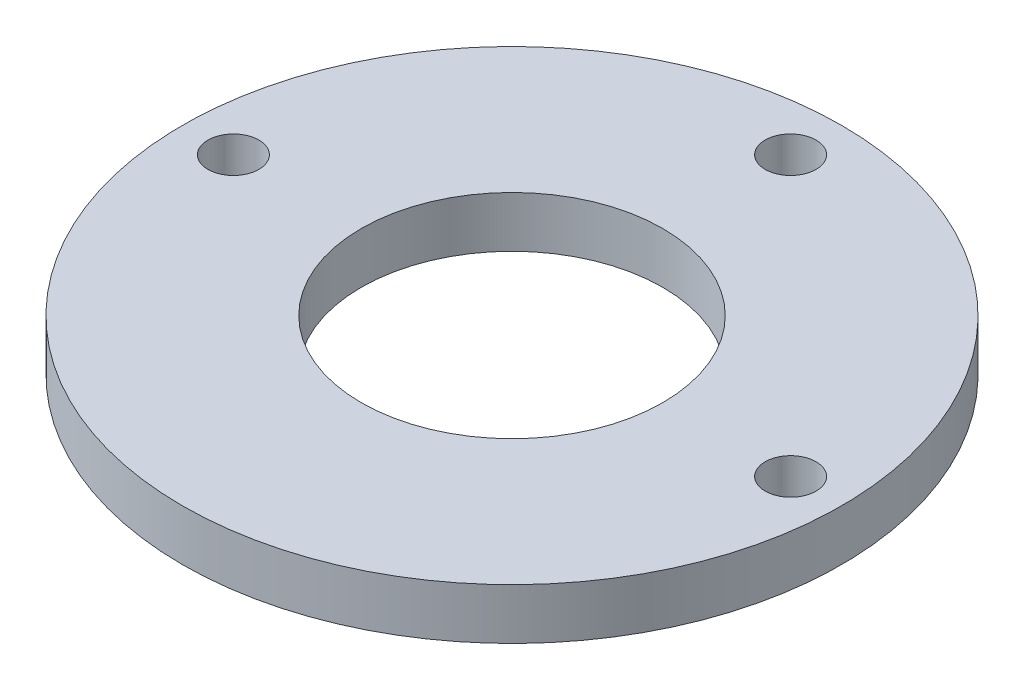
ISO-10303-21;
HEADER;
FILE_DESCRIPTION(('STEP AP214'),'2;1');
FILE_NAME('part.step','',(''),(''),'','','');
FILE_SCHEMA(('AUTOMOTIVE_DESIGN { 1 0 10303 214 1 1 1 1 }'));
ENDSEC;
DATA;
#1=APPLICATION_CONTEXT('core data for automotive mechanical design processes');
#2=APPLICATION_PROTOCOL_DEFINITION('international standard','automotive_design',2000,#1);
#3=PRODUCT_CONTEXT('',#1,'mechanical');
#4=PRODUCT('Part','Part','',(#3));
#5=PRODUCT_RELATED_PRODUCT_CATEGORY('part','',(#4));
#6=PRODUCT_DEFINITION_FORMATION('','',#4);
#7=PRODUCT_DEFINITION_CONTEXT('part definition',#1,'design');
#8=PRODUCT_DEFINITION('design','',#6,#7);
#9=PRODUCT_DEFINITION_SHAPE('','',#8);
#10=(LENGTH_UNIT() NAMED_UNIT(*) SI_UNIT(.MILLI.,.METRE.));
#11=(NAMED_UNIT(*) PLANE_ANGLE_UNIT() SI_UNIT($,.RADIAN.));
#12=(NAMED_UNIT(*) SI_UNIT($,.STERADIAN.) SOLID_ANGLE_UNIT());
#13=UNCERTAINTY_MEASURE_WITH_UNIT(LENGTH_MEASURE(1.E-05),#10,'distance_accuracy_value','');
#14=(GEOMETRIC_REPRESENTATION_CONTEXT(3) GLOBAL_UNCERTAINTY_ASSIGNED_CONTEXT((#13)) GLOBAL_UNIT_ASSIGNED_CONTEXT((#10,
#11,#12)) REPRESENTATION_CONTEXT('',''));
#15=CARTESIAN_POINT('',(0.,0.,0.));
#16=DIRECTION('',(0.,0.,1.));
#17=DIRECTION('',(1.,0.,0.));
#18=AXIS2_PLACEMENT_3D('',#15,#16,#17);
#19=CARTESIAN_POINT('',(0.,6.35,0.));
#20=DIRECTION('',(0.,-1.,0.));
#21=DIRECTION('',(0.,0.,-1.));
#22=AXIS2_PLACEMENT_3D('',#19,#20,#21);
#23=CYLINDRICAL_SURFACE('',#22,18.796);
#24=CARTESIAN_POINT('',(0.,6.35,0.));
#25=DIRECTION('',(0.,1.,0.));
#26=DIRECTION('',(0.,0.,1.));
#27=AXIS2_PLACEMENT_3D('',#24,#25,#26);
#28=CIRCLE('',#27,18.796);
#29=CARTESIAN_POINT('',(0.,6.35,18.796));
#30=VERTEX_POINT('',#29);
#31=EDGE_CURVE('E44',#30,#30,#28,.T.);
#32=ORIENTED_EDGE('',*,*,#31,.T.);
#33=EDGE_LOOP('',(#32));
#34=FACE_BOUND('',#33,.T.);
#35=CARTESIAN_POINT('',(0.,0.,0.));
#36=DIRECTION('',(0.,1.,0.));
#37=DIRECTION('',(0.,0.,1.));
#38=AXIS2_PLACEMENT_3D('',#35,#36,#37);
#39=CIRCLE('',#38,18.796);
#40=CARTESIAN_POINT('',(0.,0.,18.796));
#41=VERTEX_POINT('',#40);
#42=EDGE_CURVE('E61',#41,#41,#39,.T.);
#43=ORIENTED_EDGE('',*,*,#42,.F.);
#44=EDGE_LOOP('',(#43));
#45=FACE_BOUND('',#44,.T.);
#46=ADVANCED_FACE('F36',(#34,#45),#23,.F.);
#47=CARTESIAN_POINT('',(34.725,6.35,0.));
#48=DIRECTION('',(0.,-1.,0.));
#49=DIRECTION('',(0.,0.,-1.));
#50=AXIS2_PLACEMENT_3D('',#47,#48,#49);
#51=CYLINDRICAL_SURFACE('',#50,3.175);
#52=CARTESIAN_POINT('',(34.725,6.35,0.));
#53=DIRECTION('',(0.,1.,0.));
#54=DIRECTION('',(0.,0.,1.));
#55=AXIS2_PLACEMENT_3D('',#52,#53,#54);
#56=CIRCLE('',#55,3.175);
#57=CARTESIAN_POINT('',(34.725,6.35,3.175));
#58=VERTEX_POINT('',#57);
#59=EDGE_CURVE('E49',#58,#58,#56,.T.);
#60=ORIENTED_EDGE('',*,*,#59,.T.);
#61=EDGE_LOOP('',(#60));
#62=FACE_BOUND('',#61,.T.);
#63=CARTESIAN_POINT('',(34.725,0.,0.));
#64=DIRECTION('',(0.,1.,0.));
#65=DIRECTION('',(0.,0.,1.));
#66=AXIS2_PLACEMENT_3D('',#63,#64,#65);
#67=CIRCLE('',#66,3.175);
#68=CARTESIAN_POINT('',(34.725,0.,3.175));
#69=VERTEX_POINT('',#68);
#70=EDGE_CURVE('E59',#69,#69,#67,.T.);
#71=ORIENTED_EDGE('',*,*,#70,.F.);
#72=EDGE_LOOP('',(#71));
#73=FACE_BOUND('',#72,.T.);
#74=ADVANCED_FACE('F79',(#62,#73),#51,.F.);
#75=CARTESIAN_POINT('',(-34.725,6.35,0.));
#76=DIRECTION('',(0.,-1.,0.));
#77=DIRECTION('',(0.,0.,-1.));
#78=AXIS2_PLACEMENT_3D('',#75,#76,#77);
#79=CYLINDRICAL_SURFACE('',#78,3.175);
#80=CARTESIAN_POINT('',(-34.725,6.35,0.));
#81=DIRECTION('',(0.,1.,0.));
#82=DIRECTION('',(0.,0.,1.));
#83=AXIS2_PLACEMENT_3D('',#80,#81,#82);
#84=CIRCLE('',#83,3.175);
#85=CARTESIAN_POINT('',(-34.725,6.35,3.175));
#86=VERTEX_POINT('',#85);
#87=EDGE_CURVE('E70',#86,#86,#84,.T.);
#88=ORIENTED_EDGE('',*,*,#87,.T.);
#89=EDGE_LOOP('',(#88));
#90=FACE_BOUND('',#89,.T.);
#91=CARTESIAN_POINT('',(-34.725,0.,0.));
#92=DIRECTION('',(0.,1.,0.));
#93=DIRECTION('',(0.,0.,1.));
#94=AXIS2_PLACEMENT_3D('',#91,#92,#93);
#95=CIRCLE('',#94,3.175);
#96=CARTESIAN_POINT('',(-34.725,0.,3.175));
#97=VERTEX_POINT('',#96);
#98=EDGE_CURVE('E56',#97,#97,#95,.T.);
#99=ORIENTED_EDGE('',*,*,#98,.F.);
#100=EDGE_LOOP('',(#99));
#101=FACE_BOUND('',#100,.T.);
#102=ADVANCED_FACE('F97',(#90,#101),#79,.F.);
#103=CARTESIAN_POINT('',(0.,6.35,-34.725));
#104=DIRECTION('',(0.,-1.,0.));
#105=DIRECTION('',(0.,0.,-1.));
#106=AXIS2_PLACEMENT_3D('',#103,#104,#105);
#107=CYLINDRICAL_SURFACE('',#106,3.175);
#108=CARTESIAN_POINT('',(0.,6.35,-34.725));
#109=DIRECTION('',(0.,1.,0.));
#110=DIRECTION('',(0.,0.,1.));
#111=AXIS2_PLACEMENT_3D('',#108,#109,#110);
#112=CIRCLE('',#111,3.175);
#113=CARTESIAN_POINT('',(0.,6.35,-31.55));
#114=VERTEX_POINT('',#113);
#115=EDGE_CURVE('E66',#114,#114,#112,.T.);
#116=ORIENTED_EDGE('',*,*,#115,.T.);
#117=EDGE_LOOP('',(#116));
#118=FACE_BOUND('',#117,.T.);
#119=CARTESIAN_POINT('',(0.,0.,-34.725));
#120=DIRECTION('',(0.,1.,0.));
#121=DIRECTION('',(0.,0.,1.));
#122=AXIS2_PLACEMENT_3D('',#119,#120,#121);
#123=CIRCLE('',#122,3.175);
#124=CARTESIAN_POINT('',(0.,0.,-31.55));
#125=VERTEX_POINT('',#124);
#126=EDGE_CURVE('E53',#125,#125,#123,.T.);
#127=ORIENTED_EDGE('',*,*,#126,.F.);
#128=EDGE_LOOP('',(#127));
#129=FACE_BOUND('',#128,.T.);
#130=ADVANCED_FACE('F38',(#118,#129),#107,.F.);
#131=CARTESIAN_POINT('',(0.,6.35,0.));
#132=DIRECTION('',(0.,-1.,0.));
#133=DIRECTION('',(0.,0.,-1.));
#134=AXIS2_PLACEMENT_3D('',#131,#132,#133);
#135=CYLINDRICAL_SURFACE('',#134,41.075);
#136=CARTESIAN_POINT('',(0.,6.35,0.));
#137=DIRECTION('',(0.,1.,0.));
#138=DIRECTION('',(0.,0.,1.));
#139=AXIS2_PLACEMENT_3D('',#136,#137,#138);
#140=CIRCLE('',#139,41.075);
#141=CARTESIAN_POINT('',(0.,6.35,41.075));
#142=VERTEX_POINT('',#141);
#143=EDGE_CURVE('E10',#142,#142,#140,.T.);
#144=ORIENTED_EDGE('',*,*,#143,.F.);
#145=EDGE_LOOP('',(#144));
#146=FACE_BOUND('',#145,.T.);
#147=CARTESIAN_POINT('',(0.,0.,0.));
#148=DIRECTION('',(0.,1.,0.));
#149=DIRECTION('',(0.,0.,1.));
#150=AXIS2_PLACEMENT_3D('',#147,#148,#149);
#151=CIRCLE('',#150,41.075);
#152=CARTESIAN_POINT('',(0.,0.,41.075));
#153=VERTEX_POINT('',#152);
#154=EDGE_CURVE('E40',#153,#153,#151,.T.);
#155=ORIENTED_EDGE('',*,*,#154,.T.);
#156=EDGE_LOOP('',(#155));
#157=FACE_BOUND('',#156,.T.);
#158=ADVANCED_FACE('F86',(#146,#157),#135,.T.);
#159=CARTESIAN_POINT('',(0.,6.35,0.));
#160=DIRECTION('',(0.,1.,0.));
#161=DIRECTION('',(0.,0.,1.));
#162=AXIS2_PLACEMENT_3D('',#159,#160,#161);
#163=PLANE('',#162);
#164=ORIENTED_EDGE('',*,*,#115,.F.);
#165=EDGE_LOOP('',(#164));
#166=FACE_BOUND('',#165,.T.);
#167=ORIENTED_EDGE('',*,*,#87,.F.);
#168=EDGE_LOOP('',(#167));
#169=FACE_BOUND('',#168,.T.);
#170=ORIENTED_EDGE('',*,*,#59,.F.);
#171=EDGE_LOOP('',(#170));
#172=FACE_BOUND('',#171,.T.);
#173=ORIENTED_EDGE('',*,*,#31,.F.);
#174=EDGE_LOOP('',(#173));
#175=FACE_BOUND('',#174,.T.);
#176=ORIENTED_EDGE('',*,*,#143,.T.);
#177=EDGE_LOOP('',(#176));
#178=FACE_BOUND('',#177,.T.);
#179=ADVANCED_FACE('F82',(#166,#169,#172,#175,#178),#163,.T.);
#180=CARTESIAN_POINT('',(0.,0.,0.));
#181=DIRECTION('',(0.,1.,0.));
#182=DIRECTION('',(0.,0.,1.));
#183=AXIS2_PLACEMENT_3D('',#180,#181,#182);
#184=PLANE('',#183);
#185=ORIENTED_EDGE('',*,*,#126,.T.);
#186=EDGE_LOOP('',(#185));
#187=FACE_BOUND('',#186,.T.);
#188=ORIENTED_EDGE('',*,*,#98,.T.);
#189=EDGE_LOOP('',(#188));
#190=FACE_BOUND('',#189,.T.);
#191=ORIENTED_EDGE('',*,*,#70,.T.);
#192=EDGE_LOOP('',(#191));
#193=FACE_BOUND('',#192,.T.);
#194=ORIENTED_EDGE('',*,*,#42,.T.);
#195=EDGE_LOOP('',(#194));
#196=FACE_BOUND('',#195,.T.);
#197=ORIENTED_EDGE('',*,*,#154,.F.);
#198=EDGE_LOOP('',(#197));
#199=FACE_BOUND('',#198,.T.);
#200=ADVANCED_FACE('F85',(#187,#190,#193,#196,#199),#184,.F.);
#201=CLOSED_SHELL('',(#46,#74,#102,#130,#158,#179,#200));
#202=MANIFOLD_SOLID_BREP('B2',#201);
#203=ADVANCED_BREP_SHAPE_REPRESENTATION('',(#18,#202),#14);
#204=SHAPE_DEFINITION_REPRESENTATION(#9,#203);
ENDSEC;
END-ISO-10303-21;
